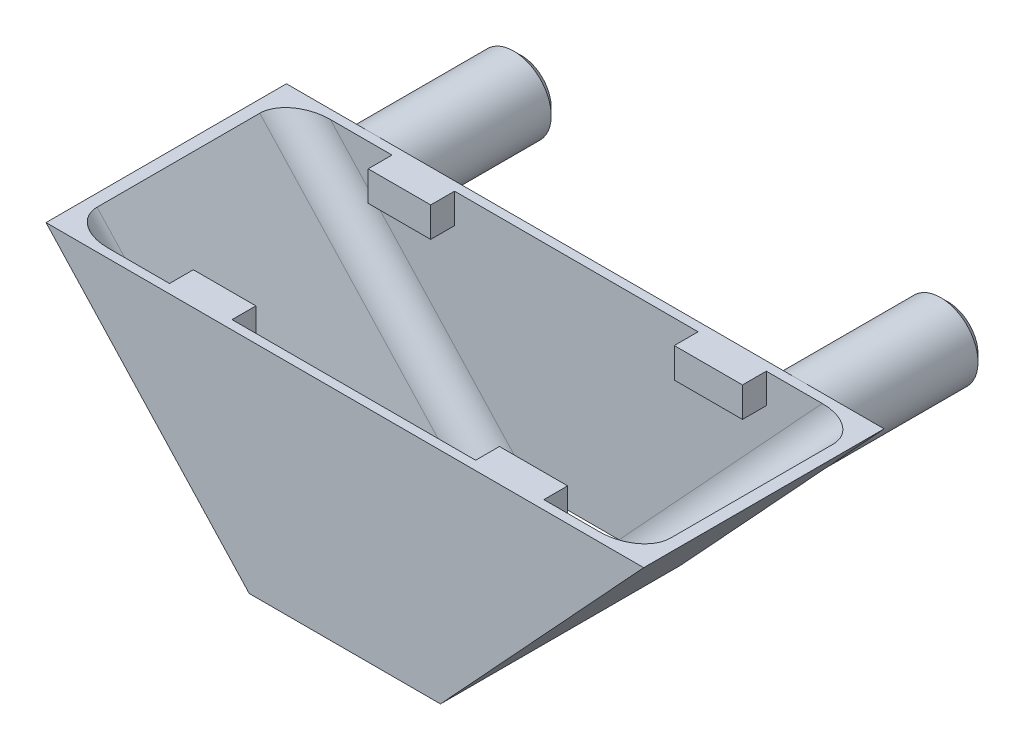
ISO-10303-21;
HEADER;
FILE_DESCRIPTION(('STEP AP214'),'2;1');
FILE_NAME('part.step','',(''),(''),'','','');
FILE_SCHEMA(('AUTOMOTIVE_DESIGN { 1 0 10303 214 1 1 1 1 }'));
ENDSEC;
DATA;
#1=APPLICATION_CONTEXT('core data for automotive mechanical design processes');
#2=APPLICATION_PROTOCOL_DEFINITION('international standard','automotive_design',2000,#1);
#3=PRODUCT_CONTEXT('',#1,'mechanical');
#4=PRODUCT('Part','Part','',(#3));
#5=PRODUCT_RELATED_PRODUCT_CATEGORY('part','',(#4));
#6=PRODUCT_DEFINITION_FORMATION('','',#4);
#7=PRODUCT_DEFINITION_CONTEXT('part definition',#1,'design');
#8=PRODUCT_DEFINITION('design','',#6,#7);
#9=PRODUCT_DEFINITION_SHAPE('','',#8);
#10=(LENGTH_UNIT() NAMED_UNIT(*) SI_UNIT(.MILLI.,.METRE.));
#11=(NAMED_UNIT(*) PLANE_ANGLE_UNIT() SI_UNIT($,.RADIAN.));
#12=(NAMED_UNIT(*) SI_UNIT($,.STERADIAN.) SOLID_ANGLE_UNIT());
#13=UNCERTAINTY_MEASURE_WITH_UNIT(LENGTH_MEASURE(1.E-05),#10,'distance_accuracy_value','');
#14=(GEOMETRIC_REPRESENTATION_CONTEXT(3) GLOBAL_UNCERTAINTY_ASSIGNED_CONTEXT((#13)) GLOBAL_UNIT_ASSIGNED_CONTEXT((#10,
#11,#12)) REPRESENTATION_CONTEXT('',''));
#15=CARTESIAN_POINT('',(0.,0.,0.));
#16=DIRECTION('',(0.,0.,1.));
#17=DIRECTION('',(1.,0.,0.));
#18=AXIS2_PLACEMENT_3D('',#15,#16,#17);
#19=CARTESIAN_POINT('',(0.,0.,15.49));
#20=DIRECTION('',(0.,0.,-1.));
#21=DIRECTION('',(-1.,0.,0.));
#22=AXIS2_PLACEMENT_3D('',#19,#20,#21);
#23=PLANE('',#22);
#24=DIRECTION('',(-1.,0.,0.));
#25=VECTOR('',#24,1.);
#26=CARTESIAN_POINT('',(0.,14.7,15.49));
#27=LINE('',#26,#25);
#28=CARTESIAN_POINT('',(8.15,14.7,15.49));
#29=VERTEX_POINT('',#28);
#30=CARTESIAN_POINT('',(-8.15,14.7,15.49));
#31=VERTEX_POINT('',#30);
#32=EDGE_CURVE('E377',#29,#31,#27,.T.);
#33=ORIENTED_EDGE('',*,*,#32,.F.);
#34=DIRECTION('',(0.,1.,0.));
#35=VECTOR('',#34,1.);
#36=CARTESIAN_POINT('',(8.15,12.7,15.49));
#37=LINE('',#36,#35);
#38=CARTESIAN_POINT('',(8.15,12.7,15.49));
#39=VERTEX_POINT('',#38);
#40=EDGE_CURVE('E50',#39,#29,#37,.T.);
#41=ORIENTED_EDGE('',*,*,#40,.F.);
#42=DIRECTION('',(-1.,0.,0.));
#43=VECTOR('',#42,1.);
#44=CARTESIAN_POINT('',(12.7139880473002,12.7,15.49));
#45=LINE('',#44,#43);
#46=CARTESIAN_POINT('',(12.7139880473002,12.7,15.49));
#47=VERTEX_POINT('',#46);
#48=EDGE_CURVE('E236',#47,#39,#45,.T.);
#49=ORIENTED_EDGE('',*,*,#48,.F.);
#50=DIRECTION('',(0.,1.,0.));
#51=VECTOR('',#50,1.);
#52=CARTESIAN_POINT('',(12.7139880473002,12.7,15.49));
#53=LINE('',#52,#51);
#54=CARTESIAN_POINT('',(12.7139880473002,14.7,15.49));
#55=VERTEX_POINT('',#54);
#56=EDGE_CURVE('E244',#47,#55,#53,.T.);
#57=ORIENTED_EDGE('',*,*,#56,.T.);
#58=CARTESIAN_POINT('',(16.4579452197533,14.7,15.49));
#59=VERTEX_POINT('',#58);
#60=EDGE_CURVE('E375',#59,#55,#27,.T.);
#61=ORIENTED_EDGE('',*,*,#60,.F.);
#62=DIRECTION('',(0.679109253274506,0.734037207583473,0.));
#63=VECTOR('',#62,1.);
#64=CARTESIAN_POINT('',(4.11452832785304,1.35821850654901,15.49));
#65=LINE('',#64,#63);
#66=CARTESIAN_POINT('',(2.85794521975328,0.,15.49));
#67=VERTEX_POINT('',#66);
#68=EDGE_CURVE('E429',#59,#67,#65,.F.);
#69=ORIENTED_EDGE('',*,*,#68,.T.);
#70=DIRECTION('',(1.,0.,0.));
#71=VECTOR('',#70,1.);
#72=CARTESIAN_POINT('',(0.,0.,15.49));
#73=LINE('',#72,#71);
#74=CARTESIAN_POINT('',(-2.85794521975327,0.,15.49));
#75=VERTEX_POINT('',#74);
#76=EDGE_CURVE('E369',#75,#67,#73,.T.);
#77=ORIENTED_EDGE('',*,*,#76,.F.);
#78=DIRECTION('',(0.679109253274506,-0.734037207583473,0.));
#79=VECTOR('',#78,1.);
#80=CARTESIAN_POINT('',(-17.714528327853,16.058218506549,15.49));
#81=LINE('',#80,#79);
#82=CARTESIAN_POINT('',(-16.4579452197533,14.7,15.49));
#83=VERTEX_POINT('',#82);
#84=EDGE_CURVE('E426',#75,#83,#81,.F.);
#85=ORIENTED_EDGE('',*,*,#84,.T.);
#86=CARTESIAN_POINT('',(-12.3350894864986,14.7,15.49));
#87=VERTEX_POINT('',#86);
#88=EDGE_CURVE('E378',#87,#83,#27,.T.);
#89=ORIENTED_EDGE('',*,*,#88,.F.);
#90=DIRECTION('',(0.,1.,0.));
#91=VECTOR('',#90,1.);
#92=CARTESIAN_POINT('',(-12.3350894864986,12.7,15.49));
#93=LINE('',#92,#91);
#94=CARTESIAN_POINT('',(-12.3350894864986,12.7,15.49));
#95=VERTEX_POINT('',#94);
#96=EDGE_CURVE('E279',#95,#87,#93,.T.);
#97=ORIENTED_EDGE('',*,*,#96,.F.);
#98=DIRECTION('',(-1.,0.,0.));
#99=VECTOR('',#98,1.);
#100=CARTESIAN_POINT('',(-8.15,12.7,15.49));
#101=LINE('',#100,#99);
#102=CARTESIAN_POINT('',(-8.15,12.7,15.49));
#103=VERTEX_POINT('',#102);
#104=EDGE_CURVE('E272',#103,#95,#101,.T.);
#105=ORIENTED_EDGE('',*,*,#104,.F.);
#106=DIRECTION('',(0.,1.,0.));
#107=VECTOR('',#106,1.);
#108=CARTESIAN_POINT('',(-8.15,12.7,15.49));
#109=LINE('',#108,#107);
#110=EDGE_CURVE('E292',#103,#31,#109,.T.);
#111=ORIENTED_EDGE('',*,*,#110,.T.);
#112=EDGE_LOOP('',(#33,#41,#49,#57,#61,#69,#77,#85,#89,#97,#105,#111));
#113=FACE_BOUND('',#112,.T.);
#114=ADVANCED_FACE('F35',(#113),#23,.T.);
#115=CARTESIAN_POINT('',(0.,0.,0.));
#116=DIRECTION('',(0.,0.,-1.));
#117=DIRECTION('',(-1.,0.,0.));
#118=AXIS2_PLACEMENT_3D('',#115,#116,#117);
#119=PLANE('',#118);
#120=DIRECTION('',(0.679109253274506,-0.734037207583473,0.));
#121=VECTOR('',#120,1.);
#122=CARTESIAN_POINT('',(-6.4,0.,0.));
#123=LINE('',#122,#121);
#124=CARTESIAN_POINT('',(-16.1163459448073,10.5022268668137,0.));
#125=VERTEX_POINT('',#124);
#126=CARTESIAN_POINT('',(-6.4,0.,0.));
#127=VERTEX_POINT('',#126);
#128=EDGE_CURVE('E408',#125,#127,#123,.T.);
#129=ORIENTED_EDGE('',*,*,#128,.F.);
#130=CARTESIAN_POINT('',(-14.2812529258486,12.2,0.));
#131=DIRECTION('',(0.,0.,-1.));
#132=DIRECTION('',(-1.,0.,0.));
#133=AXIS2_PLACEMENT_3D('',#130,#131,#132);
#134=CIRCLE('',#133,2.5);
#135=CARTESIAN_POINT('',(-14.2812529258486,14.7,0.));
#136=VERTEX_POINT('',#135);
#137=EDGE_CURVE('E349',#136,#125,#134,.T.);
#138=ORIENTED_EDGE('',*,*,#137,.F.);
#139=DIRECTION('',(-1.,0.,0.));
#140=VECTOR('',#139,1.);
#141=CARTESIAN_POINT('',(-20.,14.7,0.));
#142=LINE('',#141,#140);
#143=CARTESIAN_POINT('',(14.2812529258486,14.7,0.));
#144=VERTEX_POINT('',#143);
#145=EDGE_CURVE('E409',#144,#136,#142,.T.);
#146=ORIENTED_EDGE('',*,*,#145,.F.);
#147=CARTESIAN_POINT('',(14.2812529258486,12.2,0.));
#148=DIRECTION('',(0.,0.,-1.));
#149=DIRECTION('',(-1.,0.,0.));
#150=AXIS2_PLACEMENT_3D('',#147,#148,#149);
#151=CIRCLE('',#150,2.5);
#152=CARTESIAN_POINT('',(16.1163459448073,10.5022268668137,0.));
#153=VERTEX_POINT('',#152);
#154=EDGE_CURVE('E361',#153,#144,#151,.T.);
#155=ORIENTED_EDGE('',*,*,#154,.F.);
#156=DIRECTION('',(0.679109253274506,0.734037207583473,0.));
#157=VECTOR('',#156,1.);
#158=CARTESIAN_POINT('',(20.,14.7,0.));
#159=LINE('',#158,#157);
#160=CARTESIAN_POINT('',(6.4,0.,0.));
#161=VERTEX_POINT('',#160);
#162=EDGE_CURVE('E402',#161,#153,#159,.T.);
#163=ORIENTED_EDGE('',*,*,#162,.F.);
#164=DIRECTION('',(1.,0.,0.));
#165=VECTOR('',#164,1.);
#166=CARTESIAN_POINT('',(6.4,0.,0.));
#167=LINE('',#166,#165);
#168=EDGE_CURVE('E381',#127,#161,#167,.T.);
#169=ORIENTED_EDGE('',*,*,#168,.F.);
#170=EDGE_LOOP('',(#129,#138,#146,#155,#163,#169));
#171=FACE_BOUND('',#170,.T.);
#172=ADVANCED_FACE('F488',(#171),#119,.T.);
#173=EDGE_CURVE('E357',#144,#153,#151,.T.);
#174=ORIENTED_EDGE('',*,*,#173,.F.);
#175=CARTESIAN_POINT('',(20.,14.7,0.));
#176=VERTEX_POINT('',#175);
#177=EDGE_CURVE('E406',#176,#144,#142,.T.);
#178=ORIENTED_EDGE('',*,*,#177,.F.);
#179=EDGE_CURVE('E401',#153,#176,#159,.T.);
#180=ORIENTED_EDGE('',*,*,#179,.F.);
#181=EDGE_LOOP('',(#174,#178,#180));
#182=FACE_BOUND('',#181,.T.);
#183=ADVANCED_FACE('F493',(#182),#119,.T.);
#184=CARTESIAN_POINT('',(6.4,0.,16.09));
#185=DIRECTION('',(0.,1.,0.));
#186=DIRECTION('',(0.,0.,1.));
#187=AXIS2_PLACEMENT_3D('',#184,#185,#186);
#188=PLANE('',#187);
#189=ORIENTED_EDGE('',*,*,#168,.T.);
#190=DIRECTION('',(0.,0.,-1.));
#191=VECTOR('',#190,1.);
#192=CARTESIAN_POINT('',(6.4,0.,16.09));
#193=LINE('',#192,#191);
#194=CARTESIAN_POINT('',(6.4,0.,16.09));
#195=VERTEX_POINT('',#194);
#196=EDGE_CURVE('E420',#195,#161,#193,.T.);
#197=ORIENTED_EDGE('',*,*,#196,.F.);
#198=DIRECTION('',(1.,0.,0.));
#199=VECTOR('',#198,1.);
#200=CARTESIAN_POINT('',(6.4,0.,16.09));
#201=LINE('',#200,#199);
#202=CARTESIAN_POINT('',(-6.4,0.,16.09));
#203=VERTEX_POINT('',#202);
#204=EDGE_CURVE('E388',#203,#195,#201,.T.);
#205=ORIENTED_EDGE('',*,*,#204,.F.);
#206=DIRECTION('',(0.,0.,-1.));
#207=VECTOR('',#206,1.);
#208=CARTESIAN_POINT('',(-6.4,0.,16.09));
#209=LINE('',#208,#207);
#210=EDGE_CURVE('E398',#203,#127,#209,.T.);
#211=ORIENTED_EDGE('',*,*,#210,.T.);
#212=EDGE_LOOP('',(#189,#197,#205,#211));
#213=FACE_BOUND('',#212,.T.);
#214=DIRECTION('',(1.,0.,0.));
#215=VECTOR('',#214,1.);
#216=CARTESIAN_POINT('',(0.,0.,0.6));
#217=LINE('',#216,#215);
#218=CARTESIAN_POINT('',(-2.85794521975328,0.,0.6));
#219=VERTEX_POINT('',#218);
#220=CARTESIAN_POINT('',(2.85794521975327,0.,0.6));
#221=VERTEX_POINT('',#220);
#222=EDGE_CURVE('E360',#219,#221,#217,.T.);
#223=ORIENTED_EDGE('',*,*,#222,.F.);
#224=CARTESIAN_POINT('',(-2.85794521975327,0.,2.6));
#225=DIRECTION('',(0.,1.,0.));
#226=DIRECTION('',(1.,0.,0.));
#227=AXIS2_PLACEMENT_3D('',#224,#225,#226);
#228=ELLIPSE('',#227,2.72465752326671,2.);
#229=CARTESIAN_POINT('',(-5.58260274301999,0.,2.6));
#230=VERTEX_POINT('',#229);
#231=EDGE_CURVE('E456',#219,#230,#228,.T.);
#232=ORIENTED_EDGE('',*,*,#231,.T.);
#233=DIRECTION('',(0.,0.,-1.));
#234=VECTOR('',#233,1.);
#235=CARTESIAN_POINT('',(-5.58260274301999,0.,16.09));
#236=LINE('',#235,#234);
#237=CARTESIAN_POINT('',(-5.58260274301999,0.,13.49));
#238=VERTEX_POINT('',#237);
#239=EDGE_CURVE('E374',#238,#230,#236,.T.);
#240=ORIENTED_EDGE('',*,*,#239,.F.);
#241=CARTESIAN_POINT('',(-2.85794521975327,0.,13.49));
#242=DIRECTION('',(0.,1.,0.));
#243=DIRECTION('',(-1.,0.,0.));
#244=AXIS2_PLACEMENT_3D('',#241,#242,#243);
#245=ELLIPSE('',#244,2.72465752326671,2.);
#246=EDGE_CURVE('E438',#238,#75,#245,.T.);
#247=ORIENTED_EDGE('',*,*,#246,.T.);
#248=ORIENTED_EDGE('',*,*,#76,.T.);
#249=CARTESIAN_POINT('',(2.85794521975327,0.,13.49));
#250=DIRECTION('',(0.,1.,0.));
#251=DIRECTION('',(-1.,0.,0.));
#252=AXIS2_PLACEMENT_3D('',#249,#250,#251);
#253=ELLIPSE('',#252,2.72465752326671,2.);
#254=CARTESIAN_POINT('',(5.58260274301998,0.,13.49));
#255=VERTEX_POINT('',#254);
#256=EDGE_CURVE('E436',#67,#255,#253,.T.);
#257=ORIENTED_EDGE('',*,*,#256,.T.);
#258=DIRECTION('',(0.,0.,-1.));
#259=VECTOR('',#258,1.);
#260=CARTESIAN_POINT('',(5.58260274301998,0.,16.09));
#261=LINE('',#260,#259);
#262=CARTESIAN_POINT('',(5.58260274301998,0.,2.6));
#263=VERTEX_POINT('',#262);
#264=EDGE_CURVE('E365',#255,#263,#261,.T.);
#265=ORIENTED_EDGE('',*,*,#264,.T.);
#266=CARTESIAN_POINT('',(2.85794521975327,0.,2.6));
#267=DIRECTION('',(0.,1.,0.));
#268=DIRECTION('',(1.,0.,0.));
#269=AXIS2_PLACEMENT_3D('',#266,#267,#268);
#270=ELLIPSE('',#269,2.72465752326671,2.);
#271=EDGE_CURVE('E454',#263,#221,#270,.T.);
#272=ORIENTED_EDGE('',*,*,#271,.T.);
#273=EDGE_LOOP('',(#223,#232,#240,#247,#248,#257,#265,#272));
#274=FACE_BOUND('',#273,.T.);
#275=ADVANCED_FACE('F521',(#213,#274),#188,.F.);
#276=CARTESIAN_POINT('',(-20.,14.7,16.09));
#277=DIRECTION('',(0.,-1.,0.));
#278=DIRECTION('',(0.,0.,-1.));
#279=AXIS2_PLACEMENT_3D('',#276,#277,#278);
#280=PLANE('',#279);
#281=ORIENTED_EDGE('',*,*,#177,.T.);
#282=ORIENTED_EDGE('',*,*,#145,.T.);
#283=CARTESIAN_POINT('',(-20.,14.7,0.));
#284=VERTEX_POINT('',#283);
#285=EDGE_CURVE('E405',#136,#284,#142,.T.);
#286=ORIENTED_EDGE('',*,*,#285,.T.);
#287=DIRECTION('',(0.,0.,-1.));
#288=VECTOR('',#287,1.);
#289=CARTESIAN_POINT('',(-20.,14.7,16.09));
#290=LINE('',#289,#288);
#291=CARTESIAN_POINT('',(-20.,14.7,16.09));
#292=VERTEX_POINT('',#291);
#293=EDGE_CURVE('E414',#292,#284,#290,.T.);
#294=ORIENTED_EDGE('',*,*,#293,.F.);
#295=DIRECTION('',(-1.,0.,0.));
#296=VECTOR('',#295,1.);
#297=CARTESIAN_POINT('',(-20.,14.7,16.09));
#298=LINE('',#297,#296);
#299=CARTESIAN_POINT('',(20.,14.7,16.09));
#300=VERTEX_POINT('',#299);
#301=EDGE_CURVE('E394',#300,#292,#298,.T.);
#302=ORIENTED_EDGE('',*,*,#301,.F.);
#303=DIRECTION('',(0.,0.,-1.));
#304=VECTOR('',#303,1.);
#305=CARTESIAN_POINT('',(20.,14.7,16.09));
#306=LINE('',#305,#304);
#307=EDGE_CURVE('E417',#300,#176,#306,.T.);
#308=ORIENTED_EDGE('',*,*,#307,.T.);
#309=EDGE_LOOP('',(#281,#282,#286,#294,#302,#308));
#310=FACE_BOUND('',#309,.T.);
#311=DIRECTION('',(-1.,0.,0.));
#312=VECTOR('',#311,1.);
#313=CARTESIAN_POINT('',(0.,14.7,0.6));
#314=LINE('',#313,#312);
#315=CARTESIAN_POINT('',(16.4579452197533,14.7,0.6));
#316=VERTEX_POINT('',#315);
#317=CARTESIAN_POINT('',(12.7139880473002,14.7,0.6));
#318=VERTEX_POINT('',#317);
#319=EDGE_CURVE('E367',#316,#318,#314,.T.);
#320=ORIENTED_EDGE('',*,*,#319,.F.);
#321=CARTESIAN_POINT('',(16.4579452197533,14.7,2.6));
#322=DIRECTION('',(0.,-1.,0.));
#323=DIRECTION('',(1.,0.,0.));
#324=AXIS2_PLACEMENT_3D('',#321,#322,#323);
#325=ELLIPSE('',#324,2.72465752326671,2.);
#326=CARTESIAN_POINT('',(19.18260274302,14.7,2.6));
#327=VERTEX_POINT('',#326);
#328=EDGE_CURVE('E452',#316,#327,#325,.T.);
#329=ORIENTED_EDGE('',*,*,#328,.T.);
#330=DIRECTION('',(0.,0.,-1.));
#331=VECTOR('',#330,1.);
#332=CARTESIAN_POINT('',(19.18260274302,14.7,16.09));
#333=LINE('',#332,#331);
#334=CARTESIAN_POINT('',(19.18260274302,14.7,13.49));
#335=VERTEX_POINT('',#334);
#336=EDGE_CURVE('E362',#335,#327,#333,.T.);
#337=ORIENTED_EDGE('',*,*,#336,.F.);
#338=CARTESIAN_POINT('',(16.4579452197533,14.7,13.49));
#339=DIRECTION('',(0.,-1.,0.));
#340=DIRECTION('',(-1.,0.,0.));
#341=AXIS2_PLACEMENT_3D('',#338,#339,#340);
#342=ELLIPSE('',#341,2.72465752326671,2.);
#343=EDGE_CURVE('E434',#335,#59,#342,.T.);
#344=ORIENTED_EDGE('',*,*,#343,.T.);
#345=ORIENTED_EDGE('',*,*,#60,.T.);
#346=DIRECTION('',(0.,0.,1.));
#347=VECTOR('',#346,1.);
#348=CARTESIAN_POINT('',(12.7139880473002,14.7,13.895));
#349=LINE('',#348,#347);
#350=CARTESIAN_POINT('',(12.7139880473002,14.7,13.895));
#351=VERTEX_POINT('',#350);
#352=EDGE_CURVE('E247',#351,#55,#349,.T.);
#353=ORIENTED_EDGE('',*,*,#352,.F.);
#354=DIRECTION('',(1.,0.,0.));
#355=VECTOR('',#354,1.);
#356=CARTESIAN_POINT('',(8.15,14.7,13.895));
#357=LINE('',#356,#355);
#358=CARTESIAN_POINT('',(8.15,14.7,13.895));
#359=VERTEX_POINT('',#358);
#360=EDGE_CURVE('E257',#359,#351,#357,.T.);
#361=ORIENTED_EDGE('',*,*,#360,.F.);
#362=DIRECTION('',(0.,0.,-1.));
#363=VECTOR('',#362,1.);
#364=CARTESIAN_POINT('',(8.15,14.7,15.49));
#365=LINE('',#364,#363);
#366=EDGE_CURVE('E255',#29,#359,#365,.T.);
#367=ORIENTED_EDGE('',*,*,#366,.F.);
#368=ORIENTED_EDGE('',*,*,#32,.T.);
#369=DIRECTION('',(0.,0.,1.));
#370=VECTOR('',#369,1.);
#371=CARTESIAN_POINT('',(-8.15,14.7,13.895));
#372=LINE('',#371,#370);
#373=CARTESIAN_POINT('',(-8.15,14.7,13.895));
#374=VERTEX_POINT('',#373);
#375=EDGE_CURVE('E281',#374,#31,#372,.T.);
#376=ORIENTED_EDGE('',*,*,#375,.F.);
#377=DIRECTION('',(1.,0.,0.));
#378=VECTOR('',#377,1.);
#379=CARTESIAN_POINT('',(-12.3350894864986,14.7,13.895));
#380=LINE('',#379,#378);
#381=CARTESIAN_POINT('',(-12.3350894864986,14.7,13.895));
#382=VERTEX_POINT('',#381);
#383=EDGE_CURVE('E273',#382,#374,#380,.T.);
#384=ORIENTED_EDGE('',*,*,#383,.F.);
#385=DIRECTION('',(0.,0.,-1.));
#386=VECTOR('',#385,1.);
#387=CARTESIAN_POINT('',(-12.3350894864986,14.7,13.895));
#388=LINE('',#387,#386);
#389=EDGE_CURVE('E58',#87,#382,#388,.T.);
#390=ORIENTED_EDGE('',*,*,#389,.F.);
#391=ORIENTED_EDGE('',*,*,#88,.T.);
#392=CARTESIAN_POINT('',(-16.4579452197533,14.7,13.49));
#393=DIRECTION('',(0.,-1.,0.));
#394=DIRECTION('',(-1.,0.,0.));
#395=AXIS2_PLACEMENT_3D('',#392,#393,#394);
#396=ELLIPSE('',#395,2.72465752326671,2.);
#397=CARTESIAN_POINT('',(-19.18260274302,14.7,13.49));
#398=VERTEX_POINT('',#397);
#399=EDGE_CURVE('E440',#83,#398,#396,.T.);
#400=ORIENTED_EDGE('',*,*,#399,.T.);
#401=DIRECTION('',(0.,0.,-1.));
#402=VECTOR('',#401,1.);
#403=CARTESIAN_POINT('',(-19.18260274302,14.7,16.09));
#404=LINE('',#403,#402);
#405=CARTESIAN_POINT('',(-19.18260274302,14.7,2.6));
#406=VERTEX_POINT('',#405);
#407=EDGE_CURVE('E366',#398,#406,#404,.T.);
#408=ORIENTED_EDGE('',*,*,#407,.T.);
#409=CARTESIAN_POINT('',(-16.4579452197533,14.7,2.6));
#410=DIRECTION('',(0.,-1.,0.));
#411=DIRECTION('',(1.,0.,0.));
#412=AXIS2_PLACEMENT_3D('',#409,#410,#411);
#413=ELLIPSE('',#412,2.72465752326671,2.);
#414=CARTESIAN_POINT('',(-16.4579452197533,14.7,0.6));
#415=VERTEX_POINT('',#414);
#416=EDGE_CURVE('E458',#406,#415,#413,.T.);
#417=ORIENTED_EDGE('',*,*,#416,.T.);
#418=CARTESIAN_POINT('',(-12.3350894864986,14.7,0.6));
#419=VERTEX_POINT('',#418);
#420=EDGE_CURVE('E371',#419,#415,#314,.T.);
#421=ORIENTED_EDGE('',*,*,#420,.F.);
#422=DIRECTION('',(0.,0.,1.));
#423=VECTOR('',#422,1.);
#424=CARTESIAN_POINT('',(-12.3350894864986,14.7,2.195));
#425=LINE('',#424,#423);
#426=CARTESIAN_POINT('',(-12.3350894864986,14.7,2.195));
#427=VERTEX_POINT('',#426);
#428=EDGE_CURVE('E319',#419,#427,#425,.T.);
#429=ORIENTED_EDGE('',*,*,#428,.T.);
#430=DIRECTION('',(1.,0.,0.));
#431=VECTOR('',#430,1.);
#432=CARTESIAN_POINT('',(-12.3350894864986,14.7,2.195));
#433=LINE('',#432,#431);
#434=CARTESIAN_POINT('',(-8.15,14.7,2.195));
#435=VERTEX_POINT('',#434);
#436=EDGE_CURVE('E341',#427,#435,#433,.T.);
#437=ORIENTED_EDGE('',*,*,#436,.T.);
#438=DIRECTION('',(0.,0.,-1.));
#439=VECTOR('',#438,1.);
#440=CARTESIAN_POINT('',(-8.15,14.7,2.195));
#441=LINE('',#440,#439);
#442=CARTESIAN_POINT('',(-8.15,14.7,0.6));
#443=VERTEX_POINT('',#442);
#444=EDGE_CURVE('E330',#435,#443,#441,.T.);
#445=ORIENTED_EDGE('',*,*,#444,.T.);
#446=CARTESIAN_POINT('',(8.15,14.7,0.6));
#447=VERTEX_POINT('',#446);
#448=EDGE_CURVE('E370',#447,#443,#314,.T.);
#449=ORIENTED_EDGE('',*,*,#448,.F.);
#450=DIRECTION('',(0.,0.,1.));
#451=VECTOR('',#450,1.);
#452=CARTESIAN_POINT('',(8.15,14.7,0.6));
#453=LINE('',#452,#451);
#454=CARTESIAN_POINT('',(8.15,14.7,2.195));
#455=VERTEX_POINT('',#454);
#456=EDGE_CURVE('E288',#447,#455,#453,.T.);
#457=ORIENTED_EDGE('',*,*,#456,.T.);
#458=DIRECTION('',(1.,0.,0.));
#459=VECTOR('',#458,1.);
#460=CARTESIAN_POINT('',(8.15,14.7,2.195));
#461=LINE('',#460,#459);
#462=CARTESIAN_POINT('',(12.7139880473002,14.7,2.195));
#463=VERTEX_POINT('',#462);
#464=EDGE_CURVE('E311',#455,#463,#461,.T.);
#465=ORIENTED_EDGE('',*,*,#464,.T.);
#466=DIRECTION('',(0.,0.,-1.));
#467=VECTOR('',#466,1.);
#468=CARTESIAN_POINT('',(12.7139880473002,14.7,2.195));
#469=LINE('',#468,#467);
#470=EDGE_CURVE('E299',#463,#318,#469,.T.);
#471=ORIENTED_EDGE('',*,*,#470,.T.);
#472=EDGE_LOOP('',(#320,#329,#337,#344,#345,#353,#361,#367,#368,#376,#384,#390,#391,#400,#408,
#417,#421,#429,#437,#445,#449,#457,#465,#471));
#473=FACE_BOUND('',#472,.T.);
#474=ADVANCED_FACE('F518',(#310,#473),#280,.F.);
#475=CARTESIAN_POINT('',(20.,14.7,16.09));
#476=DIRECTION('',(-0.734037207583473,0.679109253274506,0.));
#477=DIRECTION('',(-0.679109253274506,-0.734037207583473,0.));
#478=AXIS2_PLACEMENT_3D('',#475,#476,#477);
#479=PLANE('',#478);
#480=ORIENTED_EDGE('',*,*,#162,.T.);
#481=ORIENTED_EDGE('',*,*,#179,.T.);
#482=ORIENTED_EDGE('',*,*,#307,.F.);
#483=DIRECTION('',(0.679109253274506,0.734037207583473,0.));
#484=VECTOR('',#483,1.);
#485=CARTESIAN_POINT('',(20.,14.7,16.09));
#486=LINE('',#485,#484);
#487=EDGE_CURVE('E391',#195,#300,#486,.T.);
#488=ORIENTED_EDGE('',*,*,#487,.F.);
#489=ORIENTED_EDGE('',*,*,#196,.T.);
#490=EDGE_LOOP('',(#480,#481,#482,#488,#489));
#491=FACE_BOUND('',#490,.T.);
#492=ADVANCED_FACE('F516',(#491),#479,.F.);
#493=CARTESIAN_POINT('',(-6.4,0.,16.09));
#494=DIRECTION('',(0.734037207583473,0.679109253274506,0.));
#495=DIRECTION('',(-0.679109253274506,0.734037207583473,0.));
#496=AXIS2_PLACEMENT_3D('',#493,#494,#495);
#497=PLANE('',#496);
#498=EDGE_CURVE('E392',#284,#125,#123,.T.);
#499=ORIENTED_EDGE('',*,*,#498,.T.);
#500=ORIENTED_EDGE('',*,*,#128,.T.);
#501=ORIENTED_EDGE('',*,*,#210,.F.);
#502=DIRECTION('',(0.679109253274506,-0.734037207583473,0.));
#503=VECTOR('',#502,1.);
#504=CARTESIAN_POINT('',(-6.4,0.,16.09));
#505=LINE('',#504,#503);
#506=EDGE_CURVE('E396',#292,#203,#505,.T.);
#507=ORIENTED_EDGE('',*,*,#506,.F.);
#508=ORIENTED_EDGE('',*,*,#293,.T.);
#509=EDGE_LOOP('',(#499,#500,#501,#507,#508));
#510=FACE_BOUND('',#509,.T.);
#511=ADVANCED_FACE('F508',(#510),#497,.F.);
#512=CARTESIAN_POINT('',(0.,0.,16.09));
#513=DIRECTION('',(0.,0.,-1.));
#514=DIRECTION('',(-1.,0.,0.));
#515=AXIS2_PLACEMENT_3D('',#512,#513,#514);
#516=PLANE('',#515);
#517=ORIENTED_EDGE('',*,*,#204,.T.);
#518=ORIENTED_EDGE('',*,*,#487,.T.);
#519=ORIENTED_EDGE('',*,*,#301,.T.);
#520=ORIENTED_EDGE('',*,*,#506,.T.);
#521=EDGE_LOOP('',(#517,#518,#519,#520));
#522=FACE_BOUND('',#521,.T.);
#523=ADVANCED_FACE('F506',(#522),#516,.F.);
#524=ORIENTED_EDGE('',*,*,#285,.F.);
#525=CARTESIAN_POINT('',(-14.2812529258486,12.2,0.));
#526=DIRECTION('',(0.,0.,-1.));
#527=DIRECTION('',(-1.,0.,0.));
#528=AXIS2_PLACEMENT_3D('',#525,#526,#527);
#529=CIRCLE('',#528,2.5);
#530=EDGE_CURVE('E461',#136,#125,#529,.F.);
#531=ORIENTED_EDGE('',*,*,#530,.T.);
#532=ORIENTED_EDGE('',*,*,#498,.F.);
#533=EDGE_LOOP('',(#524,#531,#532));
#534=FACE_BOUND('',#533,.T.);
#535=ADVANCED_FACE('F496',(#534),#119,.T.);
#536=CARTESIAN_POINT('',(19.5595776754499,15.1074655519647,16.09));
#537=DIRECTION('',(-0.734037207583473,0.679109253274506,0.));
#538=DIRECTION('',(-0.679109253274506,-0.734037207583473,0.));
#539=AXIS2_PLACEMENT_3D('',#536,#537,#538);
#540=PLANE('',#539);
#541=ORIENTED_EDGE('',*,*,#336,.T.);
#542=DIRECTION('',(0.679109253274506,0.734037207583473,0.));
#543=VECTOR('',#542,1.);
#544=CARTESIAN_POINT('',(19.5595776754499,15.1074655519647,2.6));
#545=LINE('',#544,#543);
#546=EDGE_CURVE('E448',#327,#263,#545,.F.);
#547=ORIENTED_EDGE('',*,*,#546,.T.);
#548=ORIENTED_EDGE('',*,*,#264,.F.);
#549=DIRECTION('',(0.679109253274506,0.734037207583473,0.));
#550=VECTOR('',#549,1.);
#551=CARTESIAN_POINT('',(19.18260274302,14.7,13.49));
#552=LINE('',#551,#550);
#553=EDGE_CURVE('E423',#255,#335,#552,.T.);
#554=ORIENTED_EDGE('',*,*,#553,.T.);
#555=EDGE_LOOP('',(#541,#547,#548,#554));
#556=FACE_BOUND('',#555,.T.);
#557=ADVANCED_FACE('F512',(#556),#540,.T.);
#558=CARTESIAN_POINT('',(-5.95957767544992,0.407465551964702,16.09));
#559=DIRECTION('',(0.734037207583473,0.679109253274506,0.));
#560=DIRECTION('',(-0.679109253274506,0.734037207583473,0.));
#561=AXIS2_PLACEMENT_3D('',#558,#559,#560);
#562=PLANE('',#561);
#563=ORIENTED_EDGE('',*,*,#239,.T.);
#564=DIRECTION('',(0.679109253274506,-0.734037207583473,0.));
#565=VECTOR('',#564,1.);
#566=CARTESIAN_POINT('',(-5.95957767544992,0.407465551964702,2.6));
#567=LINE('',#566,#565);
#568=EDGE_CURVE('E450',#230,#406,#567,.F.);
#569=ORIENTED_EDGE('',*,*,#568,.T.);
#570=ORIENTED_EDGE('',*,*,#407,.F.);
#571=DIRECTION('',(0.679109253274506,-0.734037207583473,0.));
#572=VECTOR('',#571,1.);
#573=CARTESIAN_POINT('',(-5.58260274301999,0.,13.49));
#574=LINE('',#573,#572);
#575=EDGE_CURVE('E431',#398,#238,#574,.T.);
#576=ORIENTED_EDGE('',*,*,#575,.T.);
#577=EDGE_LOOP('',(#563,#569,#570,#576));
#578=FACE_BOUND('',#577,.T.);
#579=ADVANCED_FACE('F499',(#578),#562,.T.);
#580=CARTESIAN_POINT('',(0.,0.,0.6));
#581=DIRECTION('',(0.,0.,-1.));
#582=DIRECTION('',(-1.,0.,0.));
#583=AXIS2_PLACEMENT_3D('',#580,#581,#582);
#584=PLANE('',#583);
#585=ORIENTED_EDGE('',*,*,#319,.T.);
#586=DIRECTION('',(0.,1.,0.));
#587=VECTOR('',#586,1.);
#588=CARTESIAN_POINT('',(12.7139880473002,12.7,0.6));
#589=LINE('',#588,#587);
#590=CARTESIAN_POINT('',(12.7139880473002,12.7,0.6));
#591=VERTEX_POINT('',#590);
#592=EDGE_CURVE('E316',#591,#318,#589,.T.);
#593=ORIENTED_EDGE('',*,*,#592,.F.);
#594=DIRECTION('',(-1.,0.,0.));
#595=VECTOR('',#594,1.);
#596=CARTESIAN_POINT('',(12.7139880473002,12.7,0.6));
#597=LINE('',#596,#595);
#598=CARTESIAN_POINT('',(8.15,12.7,0.6));
#599=VERTEX_POINT('',#598);
#600=EDGE_CURVE('E296',#591,#599,#597,.T.);
#601=ORIENTED_EDGE('',*,*,#600,.T.);
#602=DIRECTION('',(0.,1.,0.));
#603=VECTOR('',#602,1.);
#604=CARTESIAN_POINT('',(8.15,12.7,0.6));
#605=LINE('',#604,#603);
#606=EDGE_CURVE('E308',#599,#447,#605,.T.);
#607=ORIENTED_EDGE('',*,*,#606,.T.);
#608=ORIENTED_EDGE('',*,*,#448,.T.);
#609=DIRECTION('',(0.,1.,0.));
#610=VECTOR('',#609,1.);
#611=CARTESIAN_POINT('',(-8.15,12.7,0.6));
#612=LINE('',#611,#610);
#613=CARTESIAN_POINT('',(-8.15,12.7,0.6));
#614=VERTEX_POINT('',#613);
#615=EDGE_CURVE('E350',#614,#443,#612,.T.);
#616=ORIENTED_EDGE('',*,*,#615,.F.);
#617=DIRECTION('',(-1.,0.,0.));
#618=VECTOR('',#617,1.);
#619=CARTESIAN_POINT('',(-8.15,12.7,0.6));
#620=LINE('',#619,#618);
#621=CARTESIAN_POINT('',(-12.3350894864986,12.7,0.6));
#622=VERTEX_POINT('',#621);
#623=EDGE_CURVE('E336',#614,#622,#620,.T.);
#624=ORIENTED_EDGE('',*,*,#623,.T.);
#625=DIRECTION('',(0.,1.,0.));
#626=VECTOR('',#625,1.);
#627=CARTESIAN_POINT('',(-12.3350894864986,12.7,0.6));
#628=LINE('',#627,#626);
#629=EDGE_CURVE('E346',#622,#419,#628,.T.);
#630=ORIENTED_EDGE('',*,*,#629,.T.);
#631=ORIENTED_EDGE('',*,*,#420,.T.);
#632=DIRECTION('',(0.679109253274506,-0.734037207583473,0.));
#633=VECTOR('',#632,1.);
#634=CARTESIAN_POINT('',(-1.53989124183141,-1.42466128495967,0.6));
#635=LINE('',#634,#633);
#636=EDGE_CURVE('E442',#415,#219,#635,.T.);
#637=ORIENTED_EDGE('',*,*,#636,.T.);
#638=ORIENTED_EDGE('',*,*,#222,.T.);
#639=DIRECTION('',(0.679109253274506,0.734037207583473,0.));
#640=VECTOR('',#639,1.);
#641=CARTESIAN_POINT('',(1.5398912418314,-1.42466128495967,0.6));
#642=LINE('',#641,#640);
#643=EDGE_CURVE('E445',#221,#316,#642,.T.);
#644=ORIENTED_EDGE('',*,*,#643,.T.);
#645=EDGE_LOOP('',(#585,#593,#601,#607,#608,#616,#624,#630,#631,#637,#638,#644));
#646=FACE_BOUND('',#645,.T.);
#647=ADVANCED_FACE('F501',(#646),#584,.F.);
#648=CARTESIAN_POINT('',(18.091503260283,16.4656840585137,13.49));
#649=DIRECTION('',(-0.679109253274506,-0.734037207583473,0.));
#650=DIRECTION('',(0.734037207583473,-0.679109253274506,0.));
#651=AXIS2_PLACEMENT_3D('',#648,#649,#650);
#652=CYLINDRICAL_SURFACE('',#651,2.);
#653=ORIENTED_EDGE('',*,*,#256,.F.);
#654=ORIENTED_EDGE('',*,*,#68,.F.);
#655=ORIENTED_EDGE('',*,*,#343,.F.);
#656=ORIENTED_EDGE('',*,*,#553,.F.);
#657=EDGE_LOOP('',(#653,#654,#655,#656));
#658=FACE_BOUND('',#657,.T.);
#659=ADVANCED_FACE('F504',(#658),#652,.F.);
#660=CARTESIAN_POINT('',(-4.49150326028297,1.76568405851371,13.49));
#661=DIRECTION('',(-0.679109253274506,0.734037207583473,0.));
#662=DIRECTION('',(-0.734037207583473,-0.679109253274506,0.));
#663=AXIS2_PLACEMENT_3D('',#660,#661,#662);
#664=CYLINDRICAL_SURFACE('',#663,2.);
#665=ORIENTED_EDGE('',*,*,#399,.F.);
#666=ORIENTED_EDGE('',*,*,#84,.F.);
#667=ORIENTED_EDGE('',*,*,#246,.F.);
#668=ORIENTED_EDGE('',*,*,#575,.F.);
#669=EDGE_LOOP('',(#665,#666,#667,#668));
#670=FACE_BOUND('',#669,.T.);
#671=ADVANCED_FACE('F531',(#670),#664,.F.);
#672=CARTESIAN_POINT('',(1.5398912418314,-1.42466128495967,2.6));
#673=DIRECTION('',(0.679109253274506,0.734037207583473,0.));
#674=DIRECTION('',(-0.734037207583473,0.679109253274506,0.));
#675=AXIS2_PLACEMENT_3D('',#672,#673,#674);
#676=CYLINDRICAL_SURFACE('',#675,2.);
#677=ORIENTED_EDGE('',*,*,#271,.F.);
#678=ORIENTED_EDGE('',*,*,#546,.F.);
#679=ORIENTED_EDGE('',*,*,#328,.F.);
#680=ORIENTED_EDGE('',*,*,#643,.F.);
#681=EDGE_LOOP('',(#677,#678,#679,#680));
#682=FACE_BOUND('',#681,.T.);
#683=ADVANCED_FACE('F535',(#682),#676,.F.);
#684=CARTESIAN_POINT('',(-1.53989124183141,-1.42466128495967,2.6));
#685=DIRECTION('',(0.679109253274506,-0.734037207583473,0.));
#686=DIRECTION('',(0.734037207583473,0.679109253274506,0.));
#687=AXIS2_PLACEMENT_3D('',#684,#685,#686);
#688=CYLINDRICAL_SURFACE('',#687,2.);
#689=ORIENTED_EDGE('',*,*,#416,.F.);
#690=ORIENTED_EDGE('',*,*,#568,.F.);
#691=ORIENTED_EDGE('',*,*,#231,.F.);
#692=ORIENTED_EDGE('',*,*,#636,.F.);
#693=EDGE_LOOP('',(#689,#690,#691,#692));
#694=FACE_BOUND('',#693,.T.);
#695=ADVANCED_FACE('F539',(#694),#688,.F.);
#696=CARTESIAN_POINT('',(14.2812529258486,12.2,-10.));
#697=DIRECTION('',(0.,0.,1.));
#698=DIRECTION('',(1.,0.,0.));
#699=AXIS2_PLACEMENT_3D('',#696,#697,#698);
#700=CYLINDRICAL_SURFACE('',#699,2.5);
#701=CARTESIAN_POINT('',(14.2812529258486,12.2,-9.5));
#702=DIRECTION('',(0.,0.,-1.));
#703=DIRECTION('',(-1.,0.,0.));
#704=AXIS2_PLACEMENT_3D('',#701,#702,#703);
#705=CIRCLE('',#704,2.5);
#706=CARTESIAN_POINT('',(11.7812529258486,12.2,-9.5));
#707=VERTEX_POINT('',#706);
#708=EDGE_CURVE('E467',#707,#707,#705,.F.);
#709=ORIENTED_EDGE('',*,*,#708,.T.);
#710=EDGE_LOOP('',(#709));
#711=FACE_BOUND('',#710,.T.);
#712=ORIENTED_EDGE('',*,*,#173,.T.);
#713=ORIENTED_EDGE('',*,*,#154,.T.);
#714=EDGE_LOOP('',(#712,#713));
#715=FACE_BOUND('',#714,.T.);
#716=ADVANCED_FACE('F542',(#711,#715),#700,.T.);
#717=CARTESIAN_POINT('',(14.2812529258486,12.2,-10.));
#718=DIRECTION('',(0.,0.,-1.));
#719=DIRECTION('',(-1.,0.,0.));
#720=AXIS2_PLACEMENT_3D('',#717,#718,#719);
#721=PLANE('',#720);
#722=CARTESIAN_POINT('',(14.2812529258486,12.2,-10.));
#723=DIRECTION('',(0.,0.,-1.));
#724=DIRECTION('',(-1.,0.,0.));
#725=AXIS2_PLACEMENT_3D('',#722,#723,#724);
#726=CIRCLE('',#725,2.);
#727=CARTESIAN_POINT('',(12.2812529258486,12.2,-10.));
#728=VERTEX_POINT('',#727);
#729=EDGE_CURVE('E464',#728,#728,#726,.T.);
#730=ORIENTED_EDGE('',*,*,#729,.T.);
#731=EDGE_LOOP('',(#730));
#732=FACE_BOUND('',#731,.T.);
#733=ADVANCED_FACE('F547',(#732),#721,.T.);
#734=CARTESIAN_POINT('',(-14.2812529258486,12.2,-10.));
#735=DIRECTION('',(0.,0.,1.));
#736=DIRECTION('',(1.,0.,0.));
#737=AXIS2_PLACEMENT_3D('',#734,#735,#736);
#738=CYLINDRICAL_SURFACE('',#737,2.5);
#739=CARTESIAN_POINT('',(-14.2812529258486,12.2,-9.50000000000001));
#740=DIRECTION('',(0.,0.,-1.));
#741=DIRECTION('',(-1.,0.,0.));
#742=AXIS2_PLACEMENT_3D('',#739,#740,#741);
#743=CIRCLE('',#742,2.5);
#744=CARTESIAN_POINT('',(-16.7812529258486,12.2,-9.50000000000001));
#745=VERTEX_POINT('',#744);
#746=EDGE_CURVE('E11',#745,#745,#743,.F.);
#747=ORIENTED_EDGE('',*,*,#746,.T.);
#748=EDGE_LOOP('',(#747));
#749=FACE_BOUND('',#748,.T.);
#750=ORIENTED_EDGE('',*,*,#137,.T.);
#751=ORIENTED_EDGE('',*,*,#530,.F.);
#752=EDGE_LOOP('',(#750,#751));
#753=FACE_BOUND('',#752,.T.);
#754=ADVANCED_FACE('F607',(#749,#753),#738,.T.);
#755=CARTESIAN_POINT('',(-14.2812529258486,12.2,-10.));
#756=DIRECTION('',(0.,0.,-1.));
#757=DIRECTION('',(-1.,0.,0.));
#758=AXIS2_PLACEMENT_3D('',#755,#756,#757);
#759=PLANE('',#758);
#760=CARTESIAN_POINT('',(-14.2812529258486,12.2,-10.));
#761=DIRECTION('',(0.,0.,-1.));
#762=DIRECTION('',(-1.,0.,0.));
#763=AXIS2_PLACEMENT_3D('',#760,#761,#762);
#764=CIRCLE('',#763,2.00000000000001);
#765=CARTESIAN_POINT('',(-16.2812529258486,12.2,-10.));
#766=VERTEX_POINT('',#765);
#767=EDGE_CURVE('E43',#766,#766,#764,.T.);
#768=ORIENTED_EDGE('',*,*,#767,.T.);
#769=EDGE_LOOP('',(#768));
#770=FACE_BOUND('',#769,.T.);
#771=ADVANCED_FACE('F472',(#770),#759,.T.);
#772=CARTESIAN_POINT('',(14.2812529258486,12.2,-10.));
#773=DIRECTION('',(0.,0.,1.));
#774=DIRECTION('',(1.,0.,0.));
#775=AXIS2_PLACEMENT_3D('',#772,#773,#774);
#776=CONICAL_SURFACE('',#775,2.,0.785398163397447);
#777=ORIENTED_EDGE('',*,*,#708,.F.);
#778=EDGE_LOOP('',(#777));
#779=FACE_BOUND('',#778,.T.);
#780=ORIENTED_EDGE('',*,*,#729,.F.);
#781=EDGE_LOOP('',(#780));
#782=FACE_BOUND('',#781,.T.);
#783=ADVANCED_FACE('F476',(#779,#782),#776,.T.);
#784=CARTESIAN_POINT('',(-14.2812529258486,12.2,-10.));
#785=DIRECTION('',(0.,0.,1.));
#786=DIRECTION('',(1.,0.,0.));
#787=AXIS2_PLACEMENT_3D('',#784,#785,#786);
#788=CONICAL_SURFACE('',#787,2.00000000000001,0.785398163397447);
#789=ORIENTED_EDGE('',*,*,#746,.F.);
#790=EDGE_LOOP('',(#789));
#791=FACE_BOUND('',#790,.T.);
#792=ORIENTED_EDGE('',*,*,#767,.F.);
#793=EDGE_LOOP('',(#792));
#794=FACE_BOUND('',#793,.T.);
#795=ADVANCED_FACE('F37',(#791,#794),#788,.T.);
#796=CARTESIAN_POINT('',(-12.3350894864986,12.7,2.195));
#797=DIRECTION('',(-1.,0.,0.));
#798=DIRECTION('',(0.,0.,1.));
#799=AXIS2_PLACEMENT_3D('',#796,#797,#798);
#800=PLANE('',#799);
#801=ORIENTED_EDGE('',*,*,#428,.F.);
#802=ORIENTED_EDGE('',*,*,#629,.F.);
#803=DIRECTION('',(0.,0.,1.));
#804=VECTOR('',#803,1.);
#805=CARTESIAN_POINT('',(-12.3350894864986,12.7,2.195));
#806=LINE('',#805,#804);
#807=CARTESIAN_POINT('',(-12.3350894864986,12.7,2.195));
#808=VERTEX_POINT('',#807);
#809=EDGE_CURVE('E326',#622,#808,#806,.T.);
#810=ORIENTED_EDGE('',*,*,#809,.T.);
#811=DIRECTION('',(0.,1.,0.));
#812=VECTOR('',#811,1.);
#813=CARTESIAN_POINT('',(-12.3350894864986,12.7,2.195));
#814=LINE('',#813,#812);
#815=EDGE_CURVE('E338',#808,#427,#814,.T.);
#816=ORIENTED_EDGE('',*,*,#815,.T.);
#817=EDGE_LOOP('',(#801,#802,#810,#816));
#818=FACE_BOUND('',#817,.T.);
#819=ADVANCED_FACE('F475',(#818),#800,.T.);
#820=CARTESIAN_POINT('',(-8.15,12.7,2.195));
#821=DIRECTION('',(1.,0.,0.));
#822=DIRECTION('',(0.,0.,-1.));
#823=AXIS2_PLACEMENT_3D('',#820,#821,#822);
#824=PLANE('',#823);
#825=ORIENTED_EDGE('',*,*,#444,.F.);
#826=DIRECTION('',(0.,1.,0.));
#827=VECTOR('',#826,1.);
#828=CARTESIAN_POINT('',(-8.15,12.7,2.195));
#829=LINE('',#828,#827);
#830=CARTESIAN_POINT('',(-8.15,12.7,2.195));
#831=VERTEX_POINT('',#830);
#832=EDGE_CURVE('E353',#831,#435,#829,.T.);
#833=ORIENTED_EDGE('',*,*,#832,.F.);
#834=DIRECTION('',(0.,0.,-1.));
#835=VECTOR('',#834,1.);
#836=CARTESIAN_POINT('',(-8.15,12.7,2.195));
#837=LINE('',#836,#835);
#838=EDGE_CURVE('E333',#831,#614,#837,.T.);
#839=ORIENTED_EDGE('',*,*,#838,.T.);
#840=ORIENTED_EDGE('',*,*,#615,.T.);
#841=EDGE_LOOP('',(#825,#833,#839,#840));
#842=FACE_BOUND('',#841,.T.);
#843=ADVANCED_FACE('F482',(#842),#824,.T.);
#844=CARTESIAN_POINT('',(-12.3350894864986,12.7,2.195));
#845=DIRECTION('',(0.,0.,1.));
#846=DIRECTION('',(1.,0.,0.));
#847=AXIS2_PLACEMENT_3D('',#844,#845,#846);
#848=PLANE('',#847);
#849=ORIENTED_EDGE('',*,*,#436,.F.);
#850=ORIENTED_EDGE('',*,*,#815,.F.);
#851=DIRECTION('',(1.,0.,0.));
#852=VECTOR('',#851,1.);
#853=CARTESIAN_POINT('',(-12.3350894864986,12.7,2.195));
#854=LINE('',#853,#852);
#855=EDGE_CURVE('E329',#808,#831,#854,.T.);
#856=ORIENTED_EDGE('',*,*,#855,.T.);
#857=ORIENTED_EDGE('',*,*,#832,.T.);
#858=EDGE_LOOP('',(#849,#850,#856,#857));
#859=FACE_BOUND('',#858,.T.);
#860=ADVANCED_FACE('F583',(#859),#848,.T.);
#861=CARTESIAN_POINT('',(0.,12.7,0.));
#862=DIRECTION('',(0.,1.,0.));
#863=DIRECTION('',(0.,0.,1.));
#864=AXIS2_PLACEMENT_3D('',#861,#862,#863);
#865=PLANE('',#864);
#866=ORIENTED_EDGE('',*,*,#809,.F.);
#867=ORIENTED_EDGE('',*,*,#623,.F.);
#868=ORIENTED_EDGE('',*,*,#838,.F.);
#869=ORIENTED_EDGE('',*,*,#855,.F.);
#870=EDGE_LOOP('',(#866,#867,#868,#869));
#871=FACE_BOUND('',#870,.T.);
#872=ADVANCED_FACE('F587',(#871),#865,.F.);
#873=CARTESIAN_POINT('',(12.7139880473002,12.7,2.195));
#874=DIRECTION('',(1.,0.,0.));
#875=DIRECTION('',(0.,0.,-1.));
#876=AXIS2_PLACEMENT_3D('',#873,#874,#875);
#877=PLANE('',#876);
#878=ORIENTED_EDGE('',*,*,#470,.F.);
#879=DIRECTION('',(0.,1.,0.));
#880=VECTOR('',#879,1.);
#881=CARTESIAN_POINT('',(12.7139880473002,12.7,2.195));
#882=LINE('',#881,#880);
#883=CARTESIAN_POINT('',(12.7139880473002,12.7,2.195));
#884=VERTEX_POINT('',#883);
#885=EDGE_CURVE('E320',#884,#463,#882,.T.);
#886=ORIENTED_EDGE('',*,*,#885,.F.);
#887=DIRECTION('',(0.,0.,-1.));
#888=VECTOR('',#887,1.);
#889=CARTESIAN_POINT('',(12.7139880473002,12.7,2.195));
#890=LINE('',#889,#888);
#891=EDGE_CURVE('E305',#884,#591,#890,.T.);
#892=ORIENTED_EDGE('',*,*,#891,.T.);
#893=ORIENTED_EDGE('',*,*,#592,.T.);
#894=EDGE_LOOP('',(#878,#886,#892,#893));
#895=FACE_BOUND('',#894,.T.);
#896=ADVANCED_FACE('F589',(#895),#877,.T.);
#897=CARTESIAN_POINT('',(8.15,12.7,2.195));
#898=DIRECTION('',(0.,0.,1.));
#899=DIRECTION('',(1.,0.,0.));
#900=AXIS2_PLACEMENT_3D('',#897,#898,#899);
#901=PLANE('',#900);
#902=ORIENTED_EDGE('',*,*,#464,.F.);
#903=DIRECTION('',(0.,1.,0.));
#904=VECTOR('',#903,1.);
#905=CARTESIAN_POINT('',(8.15,12.7,2.195));
#906=LINE('',#905,#904);
#907=CARTESIAN_POINT('',(8.15,12.7,2.195));
#908=VERTEX_POINT('',#907);
#909=EDGE_CURVE('E322',#908,#455,#906,.T.);
#910=ORIENTED_EDGE('',*,*,#909,.F.);
#911=DIRECTION('',(1.,0.,0.));
#912=VECTOR('',#911,1.);
#913=CARTESIAN_POINT('',(8.15,12.7,2.195));
#914=LINE('',#913,#912);
#915=EDGE_CURVE('E302',#908,#884,#914,.T.);
#916=ORIENTED_EDGE('',*,*,#915,.T.);
#917=ORIENTED_EDGE('',*,*,#885,.T.);
#918=EDGE_LOOP('',(#902,#910,#916,#917));
#919=FACE_BOUND('',#918,.T.);
#920=ADVANCED_FACE('F595',(#919),#901,.T.);
#921=CARTESIAN_POINT('',(8.15,12.7,0.6));
#922=DIRECTION('',(-1.,0.,0.));
#923=DIRECTION('',(0.,0.,1.));
#924=AXIS2_PLACEMENT_3D('',#921,#922,#923);
#925=PLANE('',#924);
#926=ORIENTED_EDGE('',*,*,#456,.F.);
#927=ORIENTED_EDGE('',*,*,#606,.F.);
#928=DIRECTION('',(0.,0.,1.));
#929=VECTOR('',#928,1.);
#930=CARTESIAN_POINT('',(8.15,12.7,0.6));
#931=LINE('',#930,#929);
#932=EDGE_CURVE('E298',#599,#908,#931,.T.);
#933=ORIENTED_EDGE('',*,*,#932,.T.);
#934=ORIENTED_EDGE('',*,*,#909,.T.);
#935=EDGE_LOOP('',(#926,#927,#933,#934));
#936=FACE_BOUND('',#935,.T.);
#937=ADVANCED_FACE('F601',(#936),#925,.T.);
#938=CARTESIAN_POINT('',(0.,12.7,0.));
#939=DIRECTION('',(0.,1.,0.));
#940=DIRECTION('',(0.,0.,1.));
#941=AXIS2_PLACEMENT_3D('',#938,#939,#940);
#942=PLANE('',#941);
#943=ORIENTED_EDGE('',*,*,#600,.F.);
#944=ORIENTED_EDGE('',*,*,#891,.F.);
#945=ORIENTED_EDGE('',*,*,#915,.F.);
#946=ORIENTED_EDGE('',*,*,#932,.F.);
#947=EDGE_LOOP('',(#943,#944,#945,#946));
#948=FACE_BOUND('',#947,.T.);
#949=ADVANCED_FACE('F768',(#948),#942,.F.);
#950=CARTESIAN_POINT('',(-12.3350894864986,12.7,13.895));
#951=DIRECTION('',(1.,0.,0.));
#952=DIRECTION('',(0.,0.,-1.));
#953=AXIS2_PLACEMENT_3D('',#950,#951,#952);
#954=PLANE('',#953);
#955=ORIENTED_EDGE('',*,*,#389,.T.);
#956=DIRECTION('',(0.,1.,0.));
#957=VECTOR('',#956,1.);
#958=CARTESIAN_POINT('',(-12.3350894864986,12.7,13.895));
#959=LINE('',#958,#957);
#960=CARTESIAN_POINT('',(-12.3350894864986,12.7,13.895));
#961=VERTEX_POINT('',#960);
#962=EDGE_CURVE('E285',#961,#382,#959,.T.);
#963=ORIENTED_EDGE('',*,*,#962,.F.);
#964=DIRECTION('',(0.,0.,-1.));
#965=VECTOR('',#964,1.);
#966=CARTESIAN_POINT('',(-12.3350894864986,12.7,13.895));
#967=LINE('',#966,#965);
#968=EDGE_CURVE('E269',#95,#961,#967,.T.);
#969=ORIENTED_EDGE('',*,*,#968,.F.);
#970=ORIENTED_EDGE('',*,*,#96,.T.);
#971=EDGE_LOOP('',(#955,#963,#969,#970));
#972=FACE_BOUND('',#971,.T.);
#973=ADVANCED_FACE('F775',(#972),#954,.F.);
#974=CARTESIAN_POINT('',(-12.3350894864986,12.7,13.895));
#975=DIRECTION('',(0.,0.,1.));
#976=DIRECTION('',(1.,0.,0.));
#977=AXIS2_PLACEMENT_3D('',#974,#975,#976);
#978=PLANE('',#977);
#979=ORIENTED_EDGE('',*,*,#383,.T.);
#980=DIRECTION('',(0.,1.,0.));
#981=VECTOR('',#980,1.);
#982=CARTESIAN_POINT('',(-8.15,12.7,13.895));
#983=LINE('',#982,#981);
#984=CARTESIAN_POINT('',(-8.15,12.7,13.895));
#985=VERTEX_POINT('',#984);
#986=EDGE_CURVE('E289',#985,#374,#983,.T.);
#987=ORIENTED_EDGE('',*,*,#986,.F.);
#988=DIRECTION('',(1.,0.,0.));
#989=VECTOR('',#988,1.);
#990=CARTESIAN_POINT('',(-12.3350894864986,12.7,13.895));
#991=LINE('',#990,#989);
#992=EDGE_CURVE('E277',#961,#985,#991,.T.);
#993=ORIENTED_EDGE('',*,*,#992,.F.);
#994=ORIENTED_EDGE('',*,*,#962,.T.);
#995=EDGE_LOOP('',(#979,#987,#993,#994));
#996=FACE_BOUND('',#995,.T.);
#997=ADVANCED_FACE('F788',(#996),#978,.F.);
#998=CARTESIAN_POINT('',(-8.15,12.7,13.895));
#999=DIRECTION('',(-1.,0.,0.));
#1000=DIRECTION('',(0.,0.,1.));
#1001=AXIS2_PLACEMENT_3D('',#998,#999,#1000);
#1002=PLANE('',#1001);
#1003=ORIENTED_EDGE('',*,*,#375,.T.);
#1004=ORIENTED_EDGE('',*,*,#110,.F.);
#1005=DIRECTION('',(0.,0.,1.));
#1006=VECTOR('',#1005,1.);
#1007=CARTESIAN_POINT('',(-8.15,12.7,13.895));
#1008=LINE('',#1007,#1006);
#1009=EDGE_CURVE('E275',#985,#103,#1008,.T.);
#1010=ORIENTED_EDGE('',*,*,#1009,.F.);
#1011=ORIENTED_EDGE('',*,*,#986,.T.);
#1012=EDGE_LOOP('',(#1003,#1004,#1010,#1011));
#1013=FACE_BOUND('',#1012,.T.);
#1014=ADVANCED_FACE('F798',(#1013),#1002,.F.);
#1015=CARTESIAN_POINT('',(0.,12.7,16.09));
#1016=DIRECTION('',(0.,1.,0.));
#1017=DIRECTION('',(0.,0.,-1.));
#1018=AXIS2_PLACEMENT_3D('',#1015,#1016,#1017);
#1019=PLANE('',#1018);
#1020=ORIENTED_EDGE('',*,*,#968,.T.);
#1021=ORIENTED_EDGE('',*,*,#992,.T.);
#1022=ORIENTED_EDGE('',*,*,#1009,.T.);
#1023=ORIENTED_EDGE('',*,*,#104,.T.);
#1024=EDGE_LOOP('',(#1020,#1021,#1022,#1023));
#1025=FACE_BOUND('',#1024,.T.);
#1026=ADVANCED_FACE('F808',(#1025),#1019,.F.);
#1027=CARTESIAN_POINT('',(8.15,12.7,15.49));
#1028=DIRECTION('',(1.,0.,0.));
#1029=DIRECTION('',(0.,0.,-1.));
#1030=AXIS2_PLACEMENT_3D('',#1027,#1028,#1029);
#1031=PLANE('',#1030);
#1032=ORIENTED_EDGE('',*,*,#366,.T.);
#1033=DIRECTION('',(0.,1.,0.));
#1034=VECTOR('',#1033,1.);
#1035=CARTESIAN_POINT('',(8.15,12.7,13.895));
#1036=LINE('',#1035,#1034);
#1037=CARTESIAN_POINT('',(8.15,12.7,13.895));
#1038=VERTEX_POINT('',#1037);
#1039=EDGE_CURVE('E265',#1038,#359,#1036,.T.);
#1040=ORIENTED_EDGE('',*,*,#1039,.F.);
#1041=DIRECTION('',(0.,0.,-1.));
#1042=VECTOR('',#1041,1.);
#1043=CARTESIAN_POINT('',(8.15,12.7,15.49));
#1044=LINE('',#1043,#1042);
#1045=EDGE_CURVE('E252',#39,#1038,#1044,.T.);
#1046=ORIENTED_EDGE('',*,*,#1045,.F.);
#1047=ORIENTED_EDGE('',*,*,#40,.T.);
#1048=EDGE_LOOP('',(#1032,#1040,#1046,#1047));
#1049=FACE_BOUND('',#1048,.T.);
#1050=ADVANCED_FACE('F818',(#1049),#1031,.F.);
#1051=CARTESIAN_POINT('',(8.15,12.7,13.895));
#1052=DIRECTION('',(0.,0.,1.));
#1053=DIRECTION('',(1.,0.,0.));
#1054=AXIS2_PLACEMENT_3D('',#1051,#1052,#1053);
#1055=PLANE('',#1054);
#1056=ORIENTED_EDGE('',*,*,#360,.T.);
#1057=DIRECTION('',(0.,1.,0.));
#1058=VECTOR('',#1057,1.);
#1059=CARTESIAN_POINT('',(12.7139880473002,12.7,13.895));
#1060=LINE('',#1059,#1058);
#1061=CARTESIAN_POINT('',(12.7139880473002,12.7,13.895));
#1062=VERTEX_POINT('',#1061);
#1063=EDGE_CURVE('E251',#1062,#351,#1060,.T.);
#1064=ORIENTED_EDGE('',*,*,#1063,.F.);
#1065=DIRECTION('',(1.,0.,0.));
#1066=VECTOR('',#1065,1.);
#1067=CARTESIAN_POINT('',(8.15,12.7,13.895));
#1068=LINE('',#1067,#1066);
#1069=EDGE_CURVE('E238',#1038,#1062,#1068,.T.);
#1070=ORIENTED_EDGE('',*,*,#1069,.F.);
#1071=ORIENTED_EDGE('',*,*,#1039,.T.);
#1072=EDGE_LOOP('',(#1056,#1064,#1070,#1071));
#1073=FACE_BOUND('',#1072,.T.);
#1074=ADVANCED_FACE('F828',(#1073),#1055,.F.);
#1075=CARTESIAN_POINT('',(12.7139880473002,12.7,13.895));
#1076=DIRECTION('',(-1.,0.,0.));
#1077=DIRECTION('',(0.,0.,1.));
#1078=AXIS2_PLACEMENT_3D('',#1075,#1076,#1077);
#1079=PLANE('',#1078);
#1080=ORIENTED_EDGE('',*,*,#352,.T.);
#1081=ORIENTED_EDGE('',*,*,#56,.F.);
#1082=DIRECTION('',(0.,0.,1.));
#1083=VECTOR('',#1082,1.);
#1084=CARTESIAN_POINT('',(12.7139880473002,12.7,13.895));
#1085=LINE('',#1084,#1083);
#1086=EDGE_CURVE('E232',#1062,#47,#1085,.T.);
#1087=ORIENTED_EDGE('',*,*,#1086,.F.);
#1088=ORIENTED_EDGE('',*,*,#1063,.T.);
#1089=EDGE_LOOP('',(#1080,#1081,#1087,#1088));
#1090=FACE_BOUND('',#1089,.T.);
#1091=ADVANCED_FACE('F245',(#1090),#1079,.F.);
#1092=CARTESIAN_POINT('',(0.,12.7,16.09));
#1093=DIRECTION('',(0.,1.,0.));
#1094=DIRECTION('',(0.,0.,-1.));
#1095=AXIS2_PLACEMENT_3D('',#1092,#1093,#1094);
#1096=PLANE('',#1095);
#1097=ORIENTED_EDGE('',*,*,#48,.T.);
#1098=ORIENTED_EDGE('',*,*,#1045,.T.);
#1099=ORIENTED_EDGE('',*,*,#1069,.T.);
#1100=ORIENTED_EDGE('',*,*,#1086,.T.);
#1101=EDGE_LOOP('',(#1097,#1098,#1099,#1100));
#1102=FACE_BOUND('',#1101,.T.);
#1103=ADVANCED_FACE('F234',(#1102),#1096,.F.);
#1104=CLOSED_SHELL('',(#114,#172,#183,#275,#474,#492,#511,#523,#535,#557,#579,#647,#659,#671,
#683,#695,#716,#733,#754,#771,#783,#795,#819,#843,#860,#872,#896,#920,#937,#949,#973,#997,#1014,
#1026,#1050,#1074,#1091,#1103));
#1105=MANIFOLD_SOLID_BREP('B2',#1104);
#1106=ADVANCED_BREP_SHAPE_REPRESENTATION('',(#18,#1105),#14);
#1107=SHAPE_DEFINITION_REPRESENTATION(#9,#1106);
ENDSEC;
END-ISO-10303-21;
